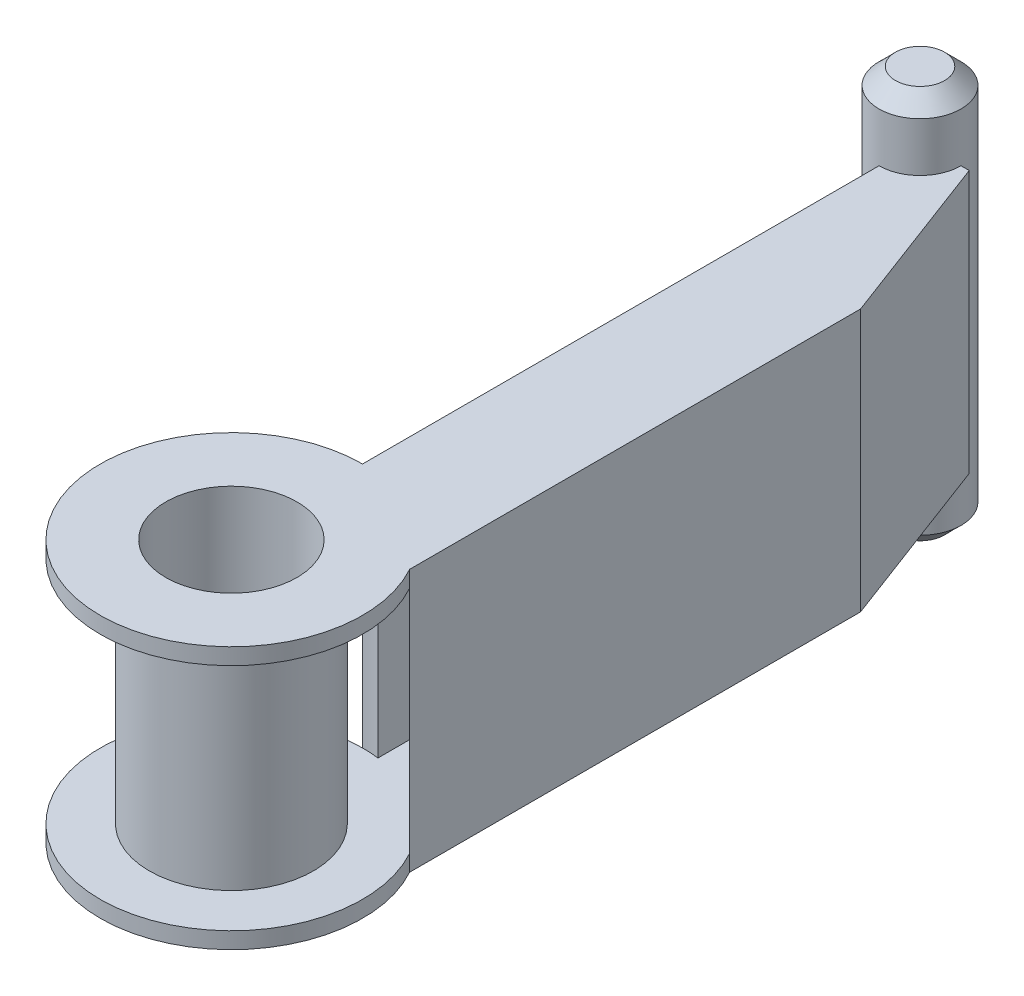
ISO-10303-21;
HEADER;
FILE_DESCRIPTION(('STEP AP214'),'2;1');
FILE_NAME('part.step','',(''),(''),'','','');
FILE_SCHEMA(('AUTOMOTIVE_DESIGN { 1 0 10303 214 1 1 1 1 }'));
ENDSEC;
DATA;
#1=APPLICATION_CONTEXT('core data for automotive mechanical design processes');
#2=APPLICATION_PROTOCOL_DEFINITION('international standard','automotive_design',2000,#1);
#3=PRODUCT_CONTEXT('',#1,'mechanical');
#4=PRODUCT('Part','Part','',(#3));
#5=PRODUCT_RELATED_PRODUCT_CATEGORY('part','',(#4));
#6=PRODUCT_DEFINITION_FORMATION('','',#4);
#7=PRODUCT_DEFINITION_CONTEXT('part definition',#1,'design');
#8=PRODUCT_DEFINITION('design','',#6,#7);
#9=PRODUCT_DEFINITION_SHAPE('','',#8);
#10=(LENGTH_UNIT() NAMED_UNIT(*) SI_UNIT(.MILLI.,.METRE.));
#11=(NAMED_UNIT(*) PLANE_ANGLE_UNIT() SI_UNIT($,.RADIAN.));
#12=(NAMED_UNIT(*) SI_UNIT($,.STERADIAN.) SOLID_ANGLE_UNIT());
#13=UNCERTAINTY_MEASURE_WITH_UNIT(LENGTH_MEASURE(1.E-05),#10,'distance_accuracy_value','');
#14=(GEOMETRIC_REPRESENTATION_CONTEXT(3) GLOBAL_UNCERTAINTY_ASSIGNED_CONTEXT((#13)) GLOBAL_UNIT_ASSIGNED_CONTEXT((#10,
#11,#12)) REPRESENTATION_CONTEXT('',''));
#15=CARTESIAN_POINT('',(0.,0.,0.));
#16=DIRECTION('',(0.,0.,1.));
#17=DIRECTION('',(1.,0.,0.));
#18=AXIS2_PLACEMENT_3D('',#15,#16,#17);
#19=CARTESIAN_POINT('',(0.,32.,-84.));
#20=DIRECTION('',(0.,0.,1.));
#21=DIRECTION('',(1.,0.,0.));
#22=AXIS2_PLACEMENT_3D('',#19,#20,#21);
#23=PLANE('',#22);
#24=DIRECTION('',(0.,-1.,0.));
#25=VECTOR('',#24,1.);
#26=CARTESIAN_POINT('',(5.,40.,-84.));
#27=LINE('',#26,#25);
#28=CARTESIAN_POINT('',(5.,32.,-84.));
#29=VERTEX_POINT('',#28);
#30=CARTESIAN_POINT('',(5.,0.,-84.));
#31=VERTEX_POINT('',#30);
#32=EDGE_CURVE('E55',#29,#31,#27,.T.);
#33=ORIENTED_EDGE('',*,*,#32,.F.);
#34=DIRECTION('',(-1.,0.,0.));
#35=VECTOR('',#34,1.);
#36=CARTESIAN_POINT('',(0.,32.,-84.));
#37=LINE('',#36,#35);
#38=CARTESIAN_POINT('',(6.,32.,-84.));
#39=VERTEX_POINT('',#38);
#40=EDGE_CURVE('E215',#39,#29,#37,.T.);
#41=ORIENTED_EDGE('',*,*,#40,.F.);
#42=DIRECTION('',(0.,-1.,0.));
#43=VECTOR('',#42,1.);
#44=CARTESIAN_POINT('',(6.,32.,-84.));
#45=LINE('',#44,#43);
#46=CARTESIAN_POINT('',(6.,0.,-84.));
#47=VERTEX_POINT('',#46);
#48=EDGE_CURVE('E232',#39,#47,#45,.T.);
#49=ORIENTED_EDGE('',*,*,#48,.T.);
#50=DIRECTION('',(-1.,0.,0.));
#51=VECTOR('',#50,1.);
#52=CARTESIAN_POINT('',(0.,0.,-84.));
#53=LINE('',#52,#51);
#54=EDGE_CURVE('E226',#47,#31,#53,.T.);
#55=ORIENTED_EDGE('',*,*,#54,.T.);
#56=EDGE_LOOP('',(#33,#41,#49,#55));
#57=FACE_BOUND('',#56,.T.);
#58=ADVANCED_FACE('F40',(#57),#23,.F.);
#59=CARTESIAN_POINT('',(0.,32.,-16.));
#60=DIRECTION('',(1.,0.,0.));
#61=DIRECTION('',(0.,0.,-1.));
#62=AXIS2_PLACEMENT_3D('',#59,#60,#61);
#63=PLANE('',#62);
#64=DIRECTION('',(0.,-1.,0.));
#65=VECTOR('',#64,1.);
#66=CARTESIAN_POINT('',(0.,40.,-79.));
#67=LINE('',#66,#65);
#68=CARTESIAN_POINT('',(0.,0.,-79.));
#69=VERTEX_POINT('',#68);
#70=CARTESIAN_POINT('',(0.,32.,-79.));
#71=VERTEX_POINT('',#70);
#72=EDGE_CURVE('E269',#69,#71,#67,.F.);
#73=ORIENTED_EDGE('',*,*,#72,.F.);
#74=DIRECTION('',(0.,0.,1.));
#75=VECTOR('',#74,1.);
#76=CARTESIAN_POINT('',(0.,0.,-16.));
#77=LINE('',#76,#75);
#78=CARTESIAN_POINT('',(0.,0.,-16.));
#79=VERTEX_POINT('',#78);
#80=EDGE_CURVE('E211',#69,#79,#77,.T.);
#81=ORIENTED_EDGE('',*,*,#80,.T.);
#82=DIRECTION('',(0.,-1.,0.));
#83=VECTOR('',#82,1.);
#84=CARTESIAN_POINT('',(0.,32.,-16.));
#85=LINE('',#84,#83);
#86=CARTESIAN_POINT('',(0.,2.,-16.));
#87=VERTEX_POINT('',#86);
#88=EDGE_CURVE('E219',#87,#79,#85,.T.);
#89=ORIENTED_EDGE('',*,*,#88,.F.);
#90=CARTESIAN_POINT('',(0.,30.,-16.));
#91=VERTEX_POINT('',#90);
#92=EDGE_CURVE('E233',#91,#87,#85,.T.);
#93=ORIENTED_EDGE('',*,*,#92,.F.);
#94=CARTESIAN_POINT('',(0.,32.,-16.));
#95=VERTEX_POINT('',#94);
#96=EDGE_CURVE('E229',#95,#91,#85,.T.);
#97=ORIENTED_EDGE('',*,*,#96,.F.);
#98=DIRECTION('',(0.,0.,1.));
#99=VECTOR('',#98,1.);
#100=CARTESIAN_POINT('',(0.,32.,-16.));
#101=LINE('',#100,#99);
#102=EDGE_CURVE('E217',#71,#95,#101,.T.);
#103=ORIENTED_EDGE('',*,*,#102,.F.);
#104=EDGE_LOOP('',(#73,#81,#89,#93,#97,#103));
#105=FACE_BOUND('',#104,.T.);
#106=ADVANCED_FACE('F319',(#105),#63,.F.);
#107=CARTESIAN_POINT('',(0.,32.,-82.));
#108=DIRECTION('',(0.,0.,1.));
#109=DIRECTION('',(1.,0.,0.));
#110=AXIS2_PLACEMENT_3D('',#107,#108,#109);
#111=PLANE('',#110);
#112=DIRECTION('',(-1.,0.,0.));
#113=VECTOR('',#112,1.);
#114=CARTESIAN_POINT('',(0.,30.,-82.));
#115=LINE('',#114,#113);
#116=CARTESIAN_POINT('',(4.61581320435923,30.,-82.));
#117=VERTEX_POINT('',#116);
#118=CARTESIAN_POINT('',(4.58257569495584,30.,-82.));
#119=VERTEX_POINT('',#118);
#120=EDGE_CURVE('E279',#117,#119,#115,.T.);
#121=ORIENTED_EDGE('',*,*,#120,.T.);
#122=DIRECTION('',(0.,-1.,0.));
#123=VECTOR('',#122,1.);
#124=CARTESIAN_POINT('',(4.58257569495584,40.,-82.));
#125=LINE('',#124,#123);
#126=CARTESIAN_POINT('',(4.58257569495584,2.,-82.));
#127=VERTEX_POINT('',#126);
#128=EDGE_CURVE('E300',#119,#127,#125,.T.);
#129=ORIENTED_EDGE('',*,*,#128,.T.);
#130=DIRECTION('',(-1.,0.,0.));
#131=VECTOR('',#130,1.);
#132=CARTESIAN_POINT('',(0.,2.,-82.));
#133=LINE('',#132,#131);
#134=CARTESIAN_POINT('',(4.61581320435923,2.,-82.));
#135=VERTEX_POINT('',#134);
#136=EDGE_CURVE('E164',#135,#127,#133,.T.);
#137=ORIENTED_EDGE('',*,*,#136,.F.);
#138=DIRECTION('',(0.,-1.,0.));
#139=VECTOR('',#138,1.);
#140=CARTESIAN_POINT('',(4.61581320435923,32.,-82.));
#141=LINE('',#140,#139);
#142=EDGE_CURVE('E187',#117,#135,#141,.T.);
#143=ORIENTED_EDGE('',*,*,#142,.F.);
#144=EDGE_LOOP('',(#121,#129,#137,#143));
#145=FACE_BOUND('',#144,.T.);
#146=ADVANCED_FACE('F299',(#145),#111,.T.);
#147=CARTESIAN_POINT('',(2.,32.,-16.));
#148=DIRECTION('',(1.,0.,0.));
#149=DIRECTION('',(0.,0.,-1.));
#150=AXIS2_PLACEMENT_3D('',#147,#148,#149);
#151=PLANE('',#150);
#152=DIRECTION('',(0.,0.,1.));
#153=VECTOR('',#152,1.);
#154=CARTESIAN_POINT('',(2.,2.,-16.));
#155=LINE('',#154,#153);
#156=CARTESIAN_POINT('',(2.,2.,-79.4174243050442));
#157=VERTEX_POINT('',#156);
#158=CARTESIAN_POINT('',(2.,2.,-15.8745078663875));
#159=VERTEX_POINT('',#158);
#160=EDGE_CURVE('E161',#157,#159,#155,.T.);
#161=ORIENTED_EDGE('',*,*,#160,.F.);
#162=DIRECTION('',(0.,-1.,0.));
#163=VECTOR('',#162,1.);
#164=CARTESIAN_POINT('',(2.,40.,-79.4174243050442));
#165=LINE('',#164,#163);
#166=CARTESIAN_POINT('',(2.,30.,-79.4174243050442));
#167=VERTEX_POINT('',#166);
#168=EDGE_CURVE('E143',#157,#167,#165,.F.);
#169=ORIENTED_EDGE('',*,*,#168,.T.);
#170=DIRECTION('',(0.,0.,1.));
#171=VECTOR('',#170,1.);
#172=CARTESIAN_POINT('',(2.,30.,-16.));
#173=LINE('',#172,#171);
#174=CARTESIAN_POINT('',(2.,30.,-15.8745078663875));
#175=VERTEX_POINT('',#174);
#176=EDGE_CURVE('E193',#167,#175,#173,.T.);
#177=ORIENTED_EDGE('',*,*,#176,.T.);
#178=DIRECTION('',(0.,-1.,0.));
#179=VECTOR('',#178,1.);
#180=CARTESIAN_POINT('',(2.,30.,-15.8745078663875));
#181=LINE('',#180,#179);
#182=EDGE_CURVE('E168',#175,#159,#181,.T.);
#183=ORIENTED_EDGE('',*,*,#182,.T.);
#184=EDGE_LOOP('',(#161,#169,#177,#183));
#185=FACE_BOUND('',#184,.T.);
#186=ADVANCED_FACE('F166',(#185),#151,.T.);
#187=CARTESIAN_POINT('',(0.,32.,0.));
#188=DIRECTION('',(0.,-1.,0.));
#189=DIRECTION('',(0.,0.,-1.));
#190=AXIS2_PLACEMENT_3D('',#187,#188,#189);
#191=CYLINDRICAL_SURFACE('',#190,16.);
#192=CARTESIAN_POINT('',(0.,2.,0.));
#193=DIRECTION('',(0.,1.,0.));
#194=DIRECTION('',(0.,0.,1.));
#195=AXIS2_PLACEMENT_3D('',#192,#193,#194);
#196=CIRCLE('',#195,16.);
#197=CARTESIAN_POINT('',(14.,2.,-7.74596669241483));
#198=VERTEX_POINT('',#197);
#199=EDGE_CURVE('E154',#87,#198,#196,.T.);
#200=ORIENTED_EDGE('',*,*,#199,.F.);
#201=ORIENTED_EDGE('',*,*,#88,.T.);
#202=CARTESIAN_POINT('',(0.,0.,0.));
#203=DIRECTION('',(0.,1.,0.));
#204=DIRECTION('',(0.,0.,1.));
#205=AXIS2_PLACEMENT_3D('',#202,#203,#204);
#206=CIRCLE('',#205,16.);
#207=CARTESIAN_POINT('',(14.,0.,-7.74596669241483));
#208=VERTEX_POINT('',#207);
#209=EDGE_CURVE('E204',#79,#208,#206,.T.);
#210=ORIENTED_EDGE('',*,*,#209,.T.);
#211=DIRECTION('',(0.,-1.,0.));
#212=VECTOR('',#211,1.);
#213=CARTESIAN_POINT('',(14.,32.,-7.74596669241483));
#214=LINE('',#213,#212);
#215=EDGE_CURVE('E239',#198,#208,#214,.T.);
#216=ORIENTED_EDGE('',*,*,#215,.F.);
#217=EDGE_LOOP('',(#200,#201,#210,#216));
#218=FACE_BOUND('',#217,.T.);
#219=ADVANCED_FACE('F315',(#218),#191,.T.);
#220=CARTESIAN_POINT('',(0.,32.,0.));
#221=DIRECTION('',(0.,1.,0.));
#222=DIRECTION('',(0.,0.,1.));
#223=AXIS2_PLACEMENT_3D('',#220,#221,#222);
#224=PLANE('',#223);
#225=ORIENTED_EDGE('',*,*,#40,.T.);
#226=CARTESIAN_POINT('',(0.,32.,-84.));
#227=DIRECTION('',(0.,1.,0.));
#228=DIRECTION('',(0.,0.,1.));
#229=AXIS2_PLACEMENT_3D('',#226,#227,#228);
#230=CIRCLE('',#229,5.);
#231=EDGE_CURVE('E268',#29,#71,#230,.F.);
#232=ORIENTED_EDGE('',*,*,#231,.T.);
#233=ORIENTED_EDGE('',*,*,#102,.T.);
#234=CARTESIAN_POINT('',(0.,32.,0.));
#235=DIRECTION('',(0.,1.,0.));
#236=DIRECTION('',(0.,0.,1.));
#237=AXIS2_PLACEMENT_3D('',#234,#235,#236);
#238=CIRCLE('',#237,16.);
#239=CARTESIAN_POINT('',(14.,32.,-7.74596669241483));
#240=VERTEX_POINT('',#239);
#241=EDGE_CURVE('E207',#95,#240,#238,.T.);
#242=ORIENTED_EDGE('',*,*,#241,.T.);
#243=DIRECTION('',(0.,0.,-1.));
#244=VECTOR('',#243,1.);
#245=CARTESIAN_POINT('',(14.,32.,-7.74596669241483));
#246=LINE('',#245,#244);
#247=CARTESIAN_POINT('',(14.,32.,-62.7459666924148));
#248=VERTEX_POINT('',#247);
#249=EDGE_CURVE('E210',#240,#248,#246,.T.);
#250=ORIENTED_EDGE('',*,*,#249,.T.);
#251=DIRECTION('',(-0.352271196090815,0.,-0.935897966877131));
#252=VECTOR('',#251,1.);
#253=CARTESIAN_POINT('',(6.,32.,-84.));
#254=LINE('',#253,#252);
#255=EDGE_CURVE('E213',#248,#39,#254,.T.);
#256=ORIENTED_EDGE('',*,*,#255,.T.);
#257=EDGE_LOOP('',(#225,#232,#233,#242,#250,#256));
#258=FACE_BOUND('',#257,.T.);
#259=CARTESIAN_POINT('',(0.,32.,0.));
#260=DIRECTION('',(0.,1.,0.));
#261=DIRECTION('',(0.,0.,1.));
#262=AXIS2_PLACEMENT_3D('',#259,#260,#261);
#263=CIRCLE('',#262,8.);
#264=CARTESIAN_POINT('',(0.,32.,8.));
#265=VERTEX_POINT('',#264);
#266=EDGE_CURVE('E201',#265,#265,#263,.T.);
#267=ORIENTED_EDGE('',*,*,#266,.F.);
#268=EDGE_LOOP('',(#267));
#269=FACE_BOUND('',#268,.T.);
#270=ADVANCED_FACE('F332',(#258,#269),#224,.T.);
#271=CARTESIAN_POINT('',(0.,0.,0.));
#272=DIRECTION('',(0.,1.,0.));
#273=DIRECTION('',(0.,0.,1.));
#274=AXIS2_PLACEMENT_3D('',#271,#272,#273);
#275=PLANE('',#274);
#276=CARTESIAN_POINT('',(0.,0.,-84.));
#277=DIRECTION('',(0.,1.,0.));
#278=DIRECTION('',(0.,0.,1.));
#279=AXIS2_PLACEMENT_3D('',#276,#277,#278);
#280=CIRCLE('',#279,5.);
#281=EDGE_CURVE('E63',#31,#69,#280,.F.);
#282=ORIENTED_EDGE('',*,*,#281,.F.);
#283=ORIENTED_EDGE('',*,*,#54,.F.);
#284=DIRECTION('',(-0.352271196090815,0.,-0.935897966877131));
#285=VECTOR('',#284,1.);
#286=CARTESIAN_POINT('',(6.,0.,-84.));
#287=LINE('',#286,#285);
#288=CARTESIAN_POINT('',(14.,0.,-62.7459666924148));
#289=VERTEX_POINT('',#288);
#290=EDGE_CURVE('E224',#289,#47,#287,.T.);
#291=ORIENTED_EDGE('',*,*,#290,.F.);
#292=DIRECTION('',(0.,0.,-1.));
#293=VECTOR('',#292,1.);
#294=CARTESIAN_POINT('',(14.,0.,-7.74596669241483));
#295=LINE('',#294,#293);
#296=EDGE_CURVE('E222',#208,#289,#295,.T.);
#297=ORIENTED_EDGE('',*,*,#296,.F.);
#298=ORIENTED_EDGE('',*,*,#209,.F.);
#299=ORIENTED_EDGE('',*,*,#80,.F.);
#300=EDGE_LOOP('',(#282,#283,#291,#297,#298,#299));
#301=FACE_BOUND('',#300,.T.);
#302=CARTESIAN_POINT('',(0.,0.,0.));
#303=DIRECTION('',(0.,1.,0.));
#304=DIRECTION('',(0.,0.,1.));
#305=AXIS2_PLACEMENT_3D('',#302,#303,#304);
#306=CIRCLE('',#305,8.);
#307=CARTESIAN_POINT('',(0.,0.,8.));
#308=VERTEX_POINT('',#307);
#309=EDGE_CURVE('E200',#308,#308,#306,.T.);
#310=ORIENTED_EDGE('',*,*,#309,.T.);
#311=EDGE_LOOP('',(#310));
#312=FACE_BOUND('',#311,.T.);
#313=ADVANCED_FACE('F321',(#301,#312),#275,.F.);
#314=ORIENTED_EDGE('',*,*,#96,.T.);
#315=CARTESIAN_POINT('',(0.,30.,0.));
#316=DIRECTION('',(0.,1.,0.));
#317=DIRECTION('',(0.,0.,1.));
#318=AXIS2_PLACEMENT_3D('',#315,#316,#317);
#319=CIRCLE('',#318,16.);
#320=CARTESIAN_POINT('',(14.,30.,-7.74596669241483));
#321=VERTEX_POINT('',#320);
#322=EDGE_CURVE('E174',#91,#321,#319,.T.);
#323=ORIENTED_EDGE('',*,*,#322,.T.);
#324=EDGE_CURVE('E240',#240,#321,#214,.T.);
#325=ORIENTED_EDGE('',*,*,#324,.F.);
#326=ORIENTED_EDGE('',*,*,#241,.F.);
#327=EDGE_LOOP('',(#314,#323,#325,#326));
#328=FACE_BOUND('',#327,.T.);
#329=ADVANCED_FACE('F339',(#328),#191,.T.);
#330=CARTESIAN_POINT('',(14.,32.,-7.74596669241483));
#331=DIRECTION('',(-1.,0.,0.));
#332=DIRECTION('',(0.,0.,1.));
#333=AXIS2_PLACEMENT_3D('',#330,#331,#332);
#334=PLANE('',#333);
#335=ORIENTED_EDGE('',*,*,#296,.T.);
#336=DIRECTION('',(0.,-1.,0.));
#337=VECTOR('',#336,1.);
#338=CARTESIAN_POINT('',(14.,32.,-62.7459666924148));
#339=LINE('',#338,#337);
#340=EDGE_CURVE('E236',#248,#289,#339,.T.);
#341=ORIENTED_EDGE('',*,*,#340,.F.);
#342=ORIENTED_EDGE('',*,*,#249,.F.);
#343=ORIENTED_EDGE('',*,*,#324,.T.);
#344=EDGE_CURVE('E242',#321,#198,#214,.T.);
#345=ORIENTED_EDGE('',*,*,#344,.T.);
#346=ORIENTED_EDGE('',*,*,#215,.T.);
#347=EDGE_LOOP('',(#335,#341,#342,#343,#345,#346));
#348=FACE_BOUND('',#347,.T.);
#349=ADVANCED_FACE('F327',(#348),#334,.F.);
#350=CARTESIAN_POINT('',(6.,32.,-84.));
#351=DIRECTION('',(-0.935897966877131,0.,0.352271196090815));
#352=DIRECTION('',(0.352271196090815,0.,0.935897966877131));
#353=AXIS2_PLACEMENT_3D('',#350,#351,#352);
#354=PLANE('',#353);
#355=ORIENTED_EDGE('',*,*,#290,.T.);
#356=ORIENTED_EDGE('',*,*,#48,.F.);
#357=ORIENTED_EDGE('',*,*,#255,.F.);
#358=ORIENTED_EDGE('',*,*,#340,.T.);
#359=EDGE_LOOP('',(#355,#356,#357,#358));
#360=FACE_BOUND('',#359,.T.);
#361=ADVANCED_FACE('F330',(#360),#354,.F.);
#362=CARTESIAN_POINT('',(0.,32.,0.));
#363=DIRECTION('',(0.,-1.,0.));
#364=DIRECTION('',(0.,0.,-1.));
#365=AXIS2_PLACEMENT_3D('',#362,#363,#364);
#366=CYLINDRICAL_SURFACE('',#365,8.);
#367=ORIENTED_EDGE('',*,*,#266,.T.);
#368=EDGE_LOOP('',(#367));
#369=FACE_BOUND('',#368,.T.);
#370=ORIENTED_EDGE('',*,*,#309,.F.);
#371=EDGE_LOOP('',(#370));
#372=FACE_BOUND('',#371,.T.);
#373=ADVANCED_FACE('F352',(#369,#372),#366,.F.);
#374=CARTESIAN_POINT('',(0.,32.,0.));
#375=DIRECTION('',(0.,-1.,0.));
#376=DIRECTION('',(0.,0.,-1.));
#377=AXIS2_PLACEMENT_3D('',#374,#375,#376);
#378=CYLINDRICAL_SURFACE('',#377,16.);
#379=ORIENTED_EDGE('',*,*,#92,.T.);
#380=EDGE_CURVE('E194',#159,#87,#196,.T.);
#381=ORIENTED_EDGE('',*,*,#380,.F.);
#382=ORIENTED_EDGE('',*,*,#182,.F.);
#383=EDGE_CURVE('E172',#175,#91,#319,.T.);
#384=ORIENTED_EDGE('',*,*,#383,.T.);
#385=EDGE_LOOP('',(#379,#381,#382,#384));
#386=FACE_BOUND('',#385,.T.);
#387=ADVANCED_FACE('F308',(#386),#378,.F.);
#388=CARTESIAN_POINT('',(0.,30.,0.));
#389=DIRECTION('',(0.,1.,0.));
#390=DIRECTION('',(0.,0.,1.));
#391=AXIS2_PLACEMENT_3D('',#388,#389,#390);
#392=PLANE('',#391);
#393=CARTESIAN_POINT('',(0.,30.,-84.));
#394=DIRECTION('',(0.,1.,0.));
#395=DIRECTION('',(0.,0.,1.));
#396=AXIS2_PLACEMENT_3D('',#393,#394,#395);
#397=CIRCLE('',#396,5.);
#398=EDGE_CURVE('E149',#119,#167,#397,.F.);
#399=ORIENTED_EDGE('',*,*,#398,.F.);
#400=ORIENTED_EDGE('',*,*,#120,.F.);
#401=DIRECTION('',(-0.352271196090815,0.,-0.935897966877131));
#402=VECTOR('',#401,1.);
#403=CARTESIAN_POINT('',(4.12820406624574,30.,-83.2954576078184));
#404=LINE('',#403,#402);
#405=CARTESIAN_POINT('',(12.,30.,-62.3820309870026));
#406=VERTEX_POINT('',#405);
#407=EDGE_CURVE('E277',#406,#117,#404,.T.);
#408=ORIENTED_EDGE('',*,*,#407,.F.);
#409=DIRECTION('',(0.,0.,-1.));
#410=VECTOR('',#409,1.);
#411=CARTESIAN_POINT('',(12.,30.,-7.74596669241483));
#412=LINE('',#411,#410);
#413=CARTESIAN_POINT('',(12.,30.,-10.5830052442584));
#414=VERTEX_POINT('',#413);
#415=EDGE_CURVE('E191',#414,#406,#412,.T.);
#416=ORIENTED_EDGE('',*,*,#415,.F.);
#417=EDGE_CURVE('E170',#321,#414,#319,.T.);
#418=ORIENTED_EDGE('',*,*,#417,.F.);
#419=ORIENTED_EDGE('',*,*,#322,.F.);
#420=ORIENTED_EDGE('',*,*,#383,.F.);
#421=ORIENTED_EDGE('',*,*,#176,.F.);
#422=EDGE_LOOP('',(#399,#400,#408,#416,#418,#419,#420,#421));
#423=FACE_BOUND('',#422,.T.);
#424=CARTESIAN_POINT('',(0.,30.,0.));
#425=DIRECTION('',(0.,1.,0.));
#426=DIRECTION('',(0.,0.,1.));
#427=AXIS2_PLACEMENT_3D('',#424,#425,#426);
#428=CIRCLE('',#427,10.);
#429=CARTESIAN_POINT('',(0.,30.,10.));
#430=VERTEX_POINT('',#429);
#431=EDGE_CURVE('E186',#430,#430,#428,.T.);
#432=ORIENTED_EDGE('',*,*,#431,.T.);
#433=EDGE_LOOP('',(#432));
#434=FACE_BOUND('',#433,.T.);
#435=ADVANCED_FACE('F304',(#423,#434),#392,.F.);
#436=CARTESIAN_POINT('',(0.,2.,0.));
#437=DIRECTION('',(0.,1.,0.));
#438=DIRECTION('',(0.,0.,1.));
#439=AXIS2_PLACEMENT_3D('',#436,#437,#438);
#440=PLANE('',#439);
#441=ORIENTED_EDGE('',*,*,#136,.T.);
#442=CARTESIAN_POINT('',(0.,2.,-84.));
#443=DIRECTION('',(0.,1.,0.));
#444=DIRECTION('',(0.,0.,1.));
#445=AXIS2_PLACEMENT_3D('',#442,#443,#444);
#446=CIRCLE('',#445,5.);
#447=EDGE_CURVE('E146',#127,#157,#446,.F.);
#448=ORIENTED_EDGE('',*,*,#447,.T.);
#449=ORIENTED_EDGE('',*,*,#160,.T.);
#450=ORIENTED_EDGE('',*,*,#380,.T.);
#451=ORIENTED_EDGE('',*,*,#199,.T.);
#452=CARTESIAN_POINT('',(12.,2.,-10.5830052442584));
#453=VERTEX_POINT('',#452);
#454=EDGE_CURVE('E196',#198,#453,#196,.T.);
#455=ORIENTED_EDGE('',*,*,#454,.T.);
#456=DIRECTION('',(0.,0.,-1.));
#457=VECTOR('',#456,1.);
#458=CARTESIAN_POINT('',(12.,2.,-7.74596669241483));
#459=LINE('',#458,#457);
#460=CARTESIAN_POINT('',(12.,2.,-62.3820309870026));
#461=VERTEX_POINT('',#460);
#462=EDGE_CURVE('E182',#453,#461,#459,.T.);
#463=ORIENTED_EDGE('',*,*,#462,.T.);
#464=DIRECTION('',(-0.352271196090815,0.,-0.935897966877131));
#465=VECTOR('',#464,1.);
#466=CARTESIAN_POINT('',(4.12820406624574,2.,-83.2954576078184));
#467=LINE('',#466,#465);
#468=EDGE_CURVE('E175',#461,#135,#467,.T.);
#469=ORIENTED_EDGE('',*,*,#468,.T.);
#470=EDGE_LOOP('',(#441,#448,#449,#450,#451,#455,#463,#469));
#471=FACE_BOUND('',#470,.T.);
#472=CARTESIAN_POINT('',(0.,2.,0.));
#473=DIRECTION('',(0.,1.,0.));
#474=DIRECTION('',(0.,0.,1.));
#475=AXIS2_PLACEMENT_3D('',#472,#473,#474);
#476=CIRCLE('',#475,10.);
#477=CARTESIAN_POINT('',(0.,2.,10.));
#478=VERTEX_POINT('',#477);
#479=EDGE_CURVE('E183',#478,#478,#476,.T.);
#480=ORIENTED_EDGE('',*,*,#479,.F.);
#481=EDGE_LOOP('',(#480));
#482=FACE_BOUND('',#481,.T.);
#483=ADVANCED_FACE('F158',(#471,#482),#440,.T.);
#484=ORIENTED_EDGE('',*,*,#417,.T.);
#485=DIRECTION('',(0.,-1.,0.));
#486=VECTOR('',#485,1.);
#487=CARTESIAN_POINT('',(12.,30.,-10.5830052442584));
#488=LINE('',#487,#486);
#489=EDGE_CURVE('E197',#414,#453,#488,.T.);
#490=ORIENTED_EDGE('',*,*,#489,.T.);
#491=ORIENTED_EDGE('',*,*,#454,.F.);
#492=ORIENTED_EDGE('',*,*,#344,.F.);
#493=EDGE_LOOP('',(#484,#490,#491,#492));
#494=FACE_BOUND('',#493,.T.);
#495=ADVANCED_FACE('F341',(#494),#378,.F.);
#496=CARTESIAN_POINT('',(12.,32.,-7.74596669241483));
#497=DIRECTION('',(-1.,0.,0.));
#498=DIRECTION('',(0.,0.,1.));
#499=AXIS2_PLACEMENT_3D('',#496,#497,#498);
#500=PLANE('',#499);
#501=ORIENTED_EDGE('',*,*,#462,.F.);
#502=ORIENTED_EDGE('',*,*,#489,.F.);
#503=ORIENTED_EDGE('',*,*,#415,.T.);
#504=DIRECTION('',(0.,-1.,0.));
#505=VECTOR('',#504,1.);
#506=CARTESIAN_POINT('',(12.,32.,-62.3820309870026));
#507=LINE('',#506,#505);
#508=EDGE_CURVE('E178',#406,#461,#507,.T.);
#509=ORIENTED_EDGE('',*,*,#508,.T.);
#510=EDGE_LOOP('',(#501,#502,#503,#509));
#511=FACE_BOUND('',#510,.T.);
#512=ADVANCED_FACE('F291',(#511),#500,.T.);
#513=CARTESIAN_POINT('',(4.12820406624574,32.,-83.2954576078184));
#514=DIRECTION('',(-0.935897966877131,0.,0.352271196090815));
#515=DIRECTION('',(0.352271196090815,0.,0.935897966877131));
#516=AXIS2_PLACEMENT_3D('',#513,#514,#515);
#517=PLANE('',#516);
#518=ORIENTED_EDGE('',*,*,#468,.F.);
#519=ORIENTED_EDGE('',*,*,#508,.F.);
#520=ORIENTED_EDGE('',*,*,#407,.T.);
#521=ORIENTED_EDGE('',*,*,#142,.T.);
#522=EDGE_LOOP('',(#518,#519,#520,#521));
#523=FACE_BOUND('',#522,.T.);
#524=ADVANCED_FACE('F295',(#523),#517,.T.);
#525=CARTESIAN_POINT('',(0.,32.,0.));
#526=DIRECTION('',(0.,-1.,0.));
#527=DIRECTION('',(0.,0.,-1.));
#528=AXIS2_PLACEMENT_3D('',#525,#526,#527);
#529=CYLINDRICAL_SURFACE('',#528,10.);
#530=ORIENTED_EDGE('',*,*,#431,.F.);
#531=EDGE_LOOP('',(#530));
#532=FACE_BOUND('',#531,.T.);
#533=ORIENTED_EDGE('',*,*,#479,.T.);
#534=EDGE_LOOP('',(#533));
#535=FACE_BOUND('',#534,.T.);
#536=ADVANCED_FACE('F382',(#532,#535),#529,.T.);
#537=CARTESIAN_POINT('',(0.,40.,-84.));
#538=DIRECTION('',(0.,-1.,0.));
#539=DIRECTION('',(0.,0.,-1.));
#540=AXIS2_PLACEMENT_3D('',#537,#538,#539);
#541=CYLINDRICAL_SURFACE('',#540,5.);
#542=ORIENTED_EDGE('',*,*,#128,.F.);
#543=ORIENTED_EDGE('',*,*,#398,.T.);
#544=ORIENTED_EDGE('',*,*,#168,.F.);
#545=ORIENTED_EDGE('',*,*,#447,.F.);
#546=EDGE_LOOP('',(#542,#543,#544,#545));
#547=FACE_BOUND('',#546,.T.);
#548=ADVANCED_FACE('F145',(#547),#541,.T.);
#549=CARTESIAN_POINT('',(0.,-6.00000000000002,-84.));
#550=DIRECTION('',(0.,1.,0.));
#551=DIRECTION('',(0.,0.,1.));
#552=AXIS2_PLACEMENT_3D('',#549,#550,#551);
#553=CIRCLE('',#552,5.);
#554=CARTESIAN_POINT('',(0.,-6.00000000000002,-79.));
#555=VERTEX_POINT('',#554);
#556=EDGE_CURVE('E246',#555,#555,#553,.T.);
#557=ORIENTED_EDGE('',*,*,#556,.T.);
#558=EDGE_LOOP('',(#557));
#559=FACE_BOUND('',#558,.T.);
#560=CARTESIAN_POINT('',(0.,38.,-84.));
#561=DIRECTION('',(0.,1.,0.));
#562=DIRECTION('',(0.,0.,1.));
#563=AXIS2_PLACEMENT_3D('',#560,#561,#562);
#564=CIRCLE('',#563,5.);
#565=CARTESIAN_POINT('',(0.,38.,-79.));
#566=VERTEX_POINT('',#565);
#567=EDGE_CURVE('E153',#566,#566,#564,.F.);
#568=ORIENTED_EDGE('',*,*,#567,.T.);
#569=EDGE_LOOP('',(#568));
#570=FACE_BOUND('',#569,.T.);
#571=ORIENTED_EDGE('',*,*,#231,.F.);
#572=ORIENTED_EDGE('',*,*,#32,.T.);
#573=ORIENTED_EDGE('',*,*,#281,.T.);
#574=ORIENTED_EDGE('',*,*,#72,.T.);
#575=EDGE_LOOP('',(#571,#572,#573,#574));
#576=FACE_BOUND('',#575,.T.);
#577=ADVANCED_FACE('F258',(#559,#570,#576),#541,.T.);
#578=CARTESIAN_POINT('',(0.,40.,-84.));
#579=DIRECTION('',(0.,1.,0.));
#580=DIRECTION('',(0.,0.,1.));
#581=AXIS2_PLACEMENT_3D('',#578,#579,#580);
#582=PLANE('',#581);
#583=CARTESIAN_POINT('',(0.,40.,-84.));
#584=DIRECTION('',(0.,1.,0.));
#585=DIRECTION('',(0.,0.,1.));
#586=AXIS2_PLACEMENT_3D('',#583,#584,#585);
#587=CIRCLE('',#586,2.99999999999999);
#588=CARTESIAN_POINT('',(0.,40.,-81.));
#589=VERTEX_POINT('',#588);
#590=EDGE_CURVE('E11',#589,#589,#587,.T.);
#591=ORIENTED_EDGE('',*,*,#590,.T.);
#592=EDGE_LOOP('',(#591));
#593=FACE_BOUND('',#592,.T.);
#594=ADVANCED_FACE('F261',(#593),#582,.T.);
#595=CARTESIAN_POINT('',(0.,-8.,-84.));
#596=DIRECTION('',(0.,1.,0.));
#597=DIRECTION('',(0.,0.,1.));
#598=AXIS2_PLACEMENT_3D('',#595,#596,#597);
#599=PLANE('',#598);
#600=CARTESIAN_POINT('',(0.,-8.,-84.));
#601=DIRECTION('',(0.,1.,0.));
#602=DIRECTION('',(0.,0.,1.));
#603=AXIS2_PLACEMENT_3D('',#600,#601,#602);
#604=CIRCLE('',#603,3.00000000000002);
#605=CARTESIAN_POINT('',(0.,-8.,-81.));
#606=VERTEX_POINT('',#605);
#607=EDGE_CURVE('E48',#606,#606,#604,.F.);
#608=ORIENTED_EDGE('',*,*,#607,.T.);
#609=EDGE_LOOP('',(#608));
#610=FACE_BOUND('',#609,.T.);
#611=ADVANCED_FACE('F251',(#610),#599,.F.);
#612=CARTESIAN_POINT('',(0.,-6.00000000000002,-84.));
#613=DIRECTION('',(0.,1.,0.));
#614=DIRECTION('',(0.,0.,1.));
#615=AXIS2_PLACEMENT_3D('',#612,#613,#614);
#616=CONICAL_SURFACE('',#615,5.,0.78539816339745);
#617=ORIENTED_EDGE('',*,*,#607,.F.);
#618=EDGE_LOOP('',(#617));
#619=FACE_BOUND('',#618,.T.);
#620=ORIENTED_EDGE('',*,*,#556,.F.);
#621=EDGE_LOOP('',(#620));
#622=FACE_BOUND('',#621,.T.);
#623=ADVANCED_FACE('F253',(#619,#622),#616,.T.);
#624=CARTESIAN_POINT('',(0.,40.,-84.));
#625=DIRECTION('',(0.,-1.,0.));
#626=DIRECTION('',(0.,0.,-1.));
#627=AXIS2_PLACEMENT_3D('',#624,#625,#626);
#628=CONICAL_SURFACE('',#627,2.99999999999999,0.785398163397446);
#629=ORIENTED_EDGE('',*,*,#567,.F.);
#630=EDGE_LOOP('',(#629));
#631=FACE_BOUND('',#630,.T.);
#632=ORIENTED_EDGE('',*,*,#590,.F.);
#633=EDGE_LOOP('',(#632));
#634=FACE_BOUND('',#633,.T.);
#635=ADVANCED_FACE('F42',(#631,#634),#628,.T.);
#636=CLOSED_SHELL('',(#58,#106,#146,#186,#219,#270,#313,#329,#349,#361,#373,#387,#435,#483,#495,
#512,#524,#536,#548,#577,#594,#611,#623,#635));
#637=MANIFOLD_SOLID_BREP('B2',#636);
#638=ADVANCED_BREP_SHAPE_REPRESENTATION('',(#18,#637),#14);
#639=SHAPE_DEFINITION_REPRESENTATION(#9,#638);
ENDSEC;
END-ISO-10303-21;
